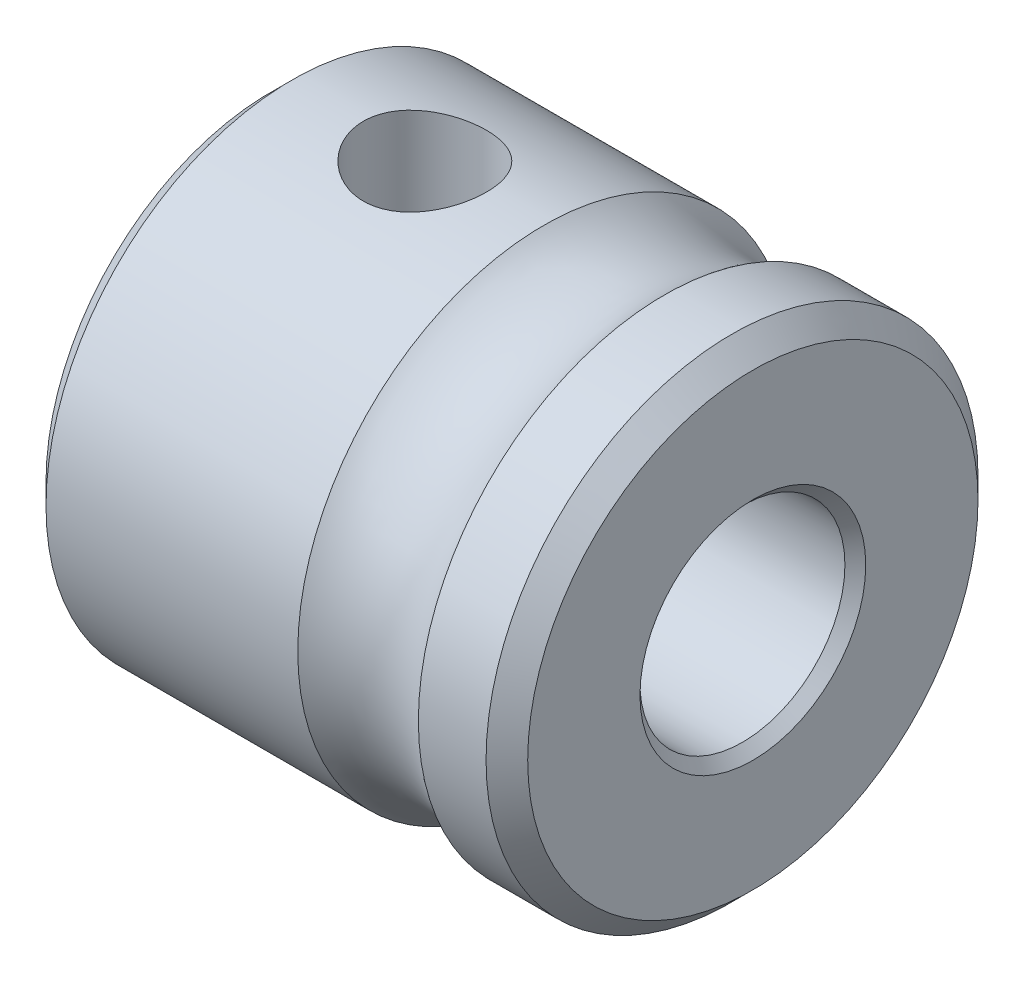
ISO-10303-21;
HEADER;
FILE_DESCRIPTION(('STEP AP214'),'2;1');
FILE_NAME('part.step','',(''),(''),'','','');
FILE_SCHEMA(('AUTOMOTIVE_DESIGN { 1 0 10303 214 1 1 1 1 }'));
ENDSEC;
DATA;
#1=APPLICATION_CONTEXT('core data for automotive mechanical design processes');
#2=APPLICATION_PROTOCOL_DEFINITION('international standard','automotive_design',2000,#1);
#3=PRODUCT_CONTEXT('',#1,'mechanical');
#4=PRODUCT('Part','Part','',(#3));
#5=PRODUCT_RELATED_PRODUCT_CATEGORY('part','',(#4));
#6=PRODUCT_DEFINITION_FORMATION('','',#4);
#7=PRODUCT_DEFINITION_CONTEXT('part definition',#1,'design');
#8=PRODUCT_DEFINITION('design','',#6,#7);
#9=PRODUCT_DEFINITION_SHAPE('','',#8);
#10=(LENGTH_UNIT() NAMED_UNIT(*) SI_UNIT(.MILLI.,.METRE.));
#11=(NAMED_UNIT(*) PLANE_ANGLE_UNIT() SI_UNIT($,.RADIAN.));
#12=(NAMED_UNIT(*) SI_UNIT($,.STERADIAN.) SOLID_ANGLE_UNIT());
#13=UNCERTAINTY_MEASURE_WITH_UNIT(LENGTH_MEASURE(1.E-05),#10,'distance_accuracy_value','');
#14=(GEOMETRIC_REPRESENTATION_CONTEXT(3) GLOBAL_UNCERTAINTY_ASSIGNED_CONTEXT((#13)) GLOBAL_UNIT_ASSIGNED_CONTEXT((#10,
#11,#12)) REPRESENTATION_CONTEXT('',''));
#15=CARTESIAN_POINT('',(0.,0.,0.));
#16=DIRECTION('',(0.,0.,1.));
#17=DIRECTION('',(1.,0.,0.));
#18=AXIS2_PLACEMENT_3D('',#15,#16,#17);
#19=CARTESIAN_POINT('',(-11.75,0.,0.));
#20=DIRECTION('',(1.,0.,0.));
#21=DIRECTION('',(0.,0.,-0.999999999999999));
#22=AXIS2_PLACEMENT_3D('',#19,#20,#21);
#23=CYLINDRICAL_SURFACE('',#22,6.);
#24=CARTESIAN_POINT('',(-11.2419999999999,0.,-3.2612801348364E-13));
#25=DIRECTION('',(1.,0.,0.));
#26=DIRECTION('',(0.,0.,-0.999999999999999));
#27=AXIS2_PLACEMENT_3D('',#24,#25,#26);
#28=CIRCLE('',#27,6.);
#29=CARTESIAN_POINT('',(-11.2419999999999,0.,-6.00000000000032));
#30=VERTEX_POINT('',#29);
#31=EDGE_CURVE('E81',#30,#30,#28,.T.);
#32=ORIENTED_EDGE('',*,*,#31,.T.);
#33=EDGE_LOOP('',(#32));
#34=FACE_BOUND('',#33,.T.);
#35=CARTESIAN_POINT('',(-5.10042822451942,0.,0.));
#36=DIRECTION('',(1.,0.,0.));
#37=DIRECTION('',(0.,0.,-0.999999999999999));
#38=AXIS2_PLACEMENT_3D('',#35,#36,#37);
#39=CIRCLE('',#38,6.);
#40=CARTESIAN_POINT('',(-5.10042822451942,0.,-5.99999999999999));
#41=VERTEX_POINT('',#40);
#42=EDGE_CURVE('E95',#41,#41,#39,.F.);
#43=ORIENTED_EDGE('',*,*,#42,.T.);
#44=EDGE_LOOP('',(#43));
#45=FACE_BOUND('',#44,.T.);
#46=CARTESIAN_POINT('',(-7.99999999999998,5.80947501931115,-1.50000000000027));
#47=CARTESIAN_POINT('',(-7.91716954944525,5.80947660051186,-1.49999764715532));
#48=CARTESIAN_POINT('',(-7.83431306079327,5.81126583608353,-1.49311574729832));
#49=CARTESIAN_POINT('',(-7.6709794530956,5.81821117195957,-1.46581387527859));
#50=CARTESIAN_POINT('',(-7.59050374731892,5.82336923173094,-1.44538602404591));
#51=CARTESIAN_POINT('',(-7.43431787708771,5.83643234757586,-1.39169471977983));
#52=CARTESIAN_POINT('',(-7.35860170676866,5.84433385614251,-1.35844783671292));
#53=CARTESIAN_POINT('',(-7.21381348847612,5.86198915217289,-1.28011268475675));
#54=CARTESIAN_POINT('',(-7.14474172275182,5.87174301827104,-1.23502391313642));
#55=CARTESIAN_POINT('',(-7.01368301284261,5.89224429813369,-1.1332250563872));
#56=CARTESIAN_POINT('',(-6.95186383978998,5.90300758573823,-1.07630213262248));
#57=CARTESIAN_POINT('',(-6.83854316338383,5.92417725309184,-0.952909238460554));
#58=CARTESIAN_POINT('',(-6.78704262462694,5.93458359939838,-0.886438376508465));
#59=CARTESIAN_POINT('',(-6.6951347194212,5.95404249312353,-0.744687120647717));
#60=CARTESIAN_POINT('',(-6.65489216710312,5.9630741244036,-0.669296745717343));
#61=CARTESIAN_POINT('',(-6.58771421350818,5.97858487155596,-0.512557910575811));
#62=CARTESIAN_POINT('',(-6.56077684885072,5.98506436400611,-0.431210331475273));
#63=CARTESIAN_POINT('',(-6.52151129925282,5.99462855308913,-0.266615255252595));
#64=CARTESIAN_POINT('',(-6.50889821340397,5.99777936306595,-0.183439631729521));
#65=CARTESIAN_POINT('',(-6.49774497243463,6.00056156464385,-0.0160972915578912));
#66=CARTESIAN_POINT('',(-6.4992027366743,6.00019347658027,0.068069276722556));
#67=CARTESIAN_POINT('',(-6.51594491015008,5.99602856972127,0.233028370758271));
#68=CARTESIAN_POINT('',(-6.53092179503216,5.99230801404534,0.31385432340132));
#69=CARTESIAN_POINT('',(-6.57378276202895,5.98194501914921,0.471807371120229));
#70=CARTESIAN_POINT('',(-6.60166753122644,5.97530242439068,0.548934269055308));
#71=CARTESIAN_POINT('',(-6.66980154241225,5.95972505820541,0.698110055252437));
#72=CARTESIAN_POINT('',(-6.71016022679694,5.95077011817041,0.770106764649608));
#73=CARTESIAN_POINT('',(-6.80201340746959,5.93153942285798,0.906413433510692));
#74=CARTESIAN_POINT('',(-6.85350984113627,5.92126343791496,0.970722052628201));
#75=CARTESIAN_POINT('',(-6.96782524518934,5.90018228261714,1.09166105262739));
#76=CARTESIAN_POINT('',(-7.03091293540851,5.88937031715559,1.1480365186128));
#77=CARTESIAN_POINT('',(-7.165759984124,5.86869026110032,1.24946456394441));
#78=CARTESIAN_POINT('',(-7.23751974769452,5.85882221463585,1.29451661406875));
#79=CARTESIAN_POINT('',(-7.38817402048933,5.84112298098991,1.37218219353366));
#80=CARTESIAN_POINT('',(-7.46710143818783,5.83330190235439,1.40473435045569));
#81=CARTESIAN_POINT('',(-7.62955128084576,5.82071184083982,1.45602843095454));
#82=CARTESIAN_POINT('',(-7.71307271838978,5.81594220486135,1.47477330982928));
#83=CARTESIAN_POINT('',(-7.87997570091379,5.81013213623488,1.49749778319909));
#84=CARTESIAN_POINT('',(-7.96330267599769,5.80899653456196,1.50185428435192));
#85=CARTESIAN_POINT('',(-8.12949316194677,5.8103240608863,1.49671019430918));
#86=CARTESIAN_POINT('',(-8.21235671477058,5.81278685760762,1.48721087870866));
#87=CARTESIAN_POINT('',(-8.37386855897273,5.8209424917274,1.45495527836196));
#88=CARTESIAN_POINT('',(-8.45256363594252,5.82658182140633,1.43241844096885));
#89=CARTESIAN_POINT('',(-8.60505887471106,5.84040430962585,1.37497084900249));
#90=CARTESIAN_POINT('',(-8.6788584554332,5.8485877694917,1.34005862862752));
#91=CARTESIAN_POINT('',(-8.82106476672035,5.86677682255959,1.25806240076186));
#92=CARTESIAN_POINT('',(-8.88933730402581,5.87681501163992,1.21075305230135));
#93=CARTESIAN_POINT('',(-9.01711301768077,5.89750249843038,1.10559043940166));
#94=CARTESIAN_POINT('',(-9.07661474998999,5.90815189637086,1.04773544220808));
#95=CARTESIAN_POINT('',(-9.18668662554252,5.92918441818967,0.921394081476989));
#96=CARTESIAN_POINT('',(-9.23699603752925,5.93955421237109,0.852677928797318));
#97=CARTESIAN_POINT('',(-9.3253615201707,5.95858329968249,0.707554024041976));
#98=CARTESIAN_POINT('',(-9.36341822996486,5.96724268202381,0.631146673436356));
#99=CARTESIAN_POINT('',(-9.42586762071669,5.98182069442994,0.473337302596588));
#100=CARTESIAN_POINT('',(-9.45035857062737,5.98775898013455,0.391976071541747));
#101=CARTESIAN_POINT('',(-9.48527620076501,5.99631176037479,0.226124640478068));
#102=CARTESIAN_POINT('',(-9.49570559524339,5.99892689636045,0.14163504756168));
#103=CARTESIAN_POINT('',(-9.50205138436323,6.00051254113217,-0.0256252896651666));
#104=CARTESIAN_POINT('',(-9.49835256364298,5.99957968320019,-0.108380740449176));
#105=CARTESIAN_POINT('',(-9.47742825905843,5.99438844686142,-0.272051244622152));
#106=CARTESIAN_POINT('',(-9.46020317748035,5.99013016735643,-0.352966352671339));
#107=CARTESIAN_POINT('',(-9.41292167034359,5.97878149280943,-0.510256553467225));
#108=CARTESIAN_POINT('',(-9.38293482002795,5.97170646754004,-0.58665374187155));
#109=CARTESIAN_POINT('',(-9.31104413147088,5.95546933370083,-0.733375579562371));
#110=CARTESIAN_POINT('',(-9.2691387909956,5.94630696206607,-0.80369946189787));
#111=CARTESIAN_POINT('',(-9.17342714900428,5.92660874522001,-0.93810289263613));
#112=CARTESIAN_POINT('',(-9.11935978563869,5.91604525418421,-1.00199248245102));
#113=CARTESIAN_POINT('',(-9.00136572203909,5.89485973579867,-1.11992253040705));
#114=CARTESIAN_POINT('',(-8.93743652585309,5.88423769428834,-1.1739604876026));
#115=CARTESIAN_POINT('',(-8.80009787869802,5.86391213790825,-1.27164303971913));
#116=CARTESIAN_POINT('',(-8.72653381488098,5.85422945594835,-1.31507492916992));
#117=CARTESIAN_POINT('',(-8.5729167651158,5.83715933325929,-1.38889034492343));
#118=CARTESIAN_POINT('',(-8.49286855083978,5.82977022370053,-1.41928336463954));
#119=CARTESIAN_POINT('',(-8.34413448225985,5.81927863109675,-1.4616337928481));
#120=CARTESIAN_POINT('',(-8.27616025342414,5.81562994500826,-1.47598975589298));
#121=CARTESIAN_POINT('',(-8.1387966965,5.81072757878366,-1.49517343885999));
#122=CARTESIAN_POINT('',(-8.06940748963236,5.80947369434948,-1.50000197155856));
#123=CARTESIAN_POINT('',(-7.99999999999998,5.80947501931115,-1.50000000000027));
#124=B_SPLINE_CURVE_WITH_KNOTS('',3,(#46,#47,#48,#49,#50,#51,#52,#53,#54,#55,#56,#57,#58,#59,
#60,#61,#62,#63,#64,#65,#66,#67,#68,#69,#70,#71,#72,#73,#74,#75,#76,#77,#78,#79,#80,#81,#82,#83,
#84,#85,#86,#87,#88,#89,#90,#91,#92,#93,#94,#95,#96,#97,#98,#99,#100,#101,#102,#103,#104,#105,
#106,#107,#108,#109,#110,#111,#112,#113,#114,#115,#116,#117,#118,#119,#120,#121,#122,#123),
.UNSPECIFIED.,.T.,.F.,(4,2,2,2,2,2,2,2,2,2,2,2,2,2,2,2,2,2,2,2,2,2,2,2,2,2,2,2,2,2,2,2,2,2,2,2,
2,2,4),(0.,0.248236465041644,0.496617444857094,0.74467843629962,0.992749960533055,
1.2457437251579,1.49876112887904,1.75530897838748,2.01181895908267,2.26313250597209,
2.51440889199599,2.76010957613354,3.0058233403486,3.25375724552669,3.5017343128136,
3.75642279943149,4.0111231871988,4.26705859205049,4.52293920077736,4.77206144857034,
5.02116076310292,5.26618443005535,5.51123712852852,5.76109707515495,6.01099811331033,
6.26715198579195,6.5232924943173,6.77755243684166,7.03176329345442,7.27910067676479,
7.5264307042618,7.77242925935835,8.0184588344287,8.27038257949265,8.52237018939321,
8.77905886370815,9.03556032819977,9.24358696306401,9.45159585059714),.UNSPECIFIED.);
#125=CARTESIAN_POINT('',(-7.99999999999998,5.80947501931115,-1.50000000000027));
#126=VERTEX_POINT('',#125);
#127=EDGE_CURVE('E94',#126,#126,#124,.T.);
#128=ORIENTED_EDGE('',*,*,#127,.T.);
#129=EDGE_LOOP('',(#128));
#130=FACE_BOUND('',#129,.T.);
#131=ADVANCED_FACE('F51',(#34,#45,#130),#23,.T.);
#132=CARTESIAN_POINT('',(-11.75,0.,0.));
#133=DIRECTION('',(1.,0.,0.));
#134=DIRECTION('',(0.,0.,-0.999999999999999));
#135=AXIS2_PLACEMENT_3D('',#132,#133,#134);
#136=CYLINDRICAL_SURFACE('',#135,2.5);
#137=CARTESIAN_POINT('',(-0.254000000000004,0.,0.));
#138=DIRECTION('',(1.,0.,0.));
#139=DIRECTION('',(0.,0.,-0.999999999999999));
#140=AXIS2_PLACEMENT_3D('',#137,#138,#139);
#141=CIRCLE('',#140,2.5);
#142=CARTESIAN_POINT('',(-0.254000000000004,0.,-2.49999999999999));
#143=VERTEX_POINT('',#142);
#144=EDGE_CURVE('E59',#143,#143,#141,.T.);
#145=ORIENTED_EDGE('',*,*,#144,.T.);
#146=EDGE_LOOP('',(#145));
#147=FACE_BOUND('',#146,.T.);
#148=CARTESIAN_POINT('',(-11.75,0.,0.));
#149=DIRECTION('',(1.,0.,0.));
#150=DIRECTION('',(0.,0.,-0.999999999999999));
#151=AXIS2_PLACEMENT_3D('',#148,#149,#150);
#152=CIRCLE('',#151,2.5);
#153=CARTESIAN_POINT('',(-11.75,0.,-2.5));
#154=VERTEX_POINT('',#153);
#155=EDGE_CURVE('E85',#154,#154,#152,.T.);
#156=ORIENTED_EDGE('',*,*,#155,.F.);
#157=EDGE_LOOP('',(#156));
#158=FACE_BOUND('',#157,.T.);
#159=CARTESIAN_POINT('',(-7.9999999999999,2.00000000000007,-1.49999999999994));
#160=CARTESIAN_POINT('',(-7.92452102471029,1.99999416642519,-1.50000404108584));
#161=CARTESIAN_POINT('',(-7.84906156592018,2.00433633903489,-1.49426852823997));
#162=CARTESIAN_POINT('',(-7.70067609603773,2.02092590613888,-1.47174965152804));
#163=CARTESIAN_POINT('',(-7.62775281261479,2.03318155043099,-1.45495475788995));
#164=CARTESIAN_POINT('',(-7.4869163583227,2.06362339034729,-1.41143486335855));
#165=CARTESIAN_POINT('',(-7.41897116196487,2.08176666183119,-1.38478154503169));
#166=CARTESIAN_POINT('',(-7.28856254663224,2.12185904995837,-1.32252909283021));
#167=CARTESIAN_POINT('',(-7.22610077030489,2.14380930122418,-1.28692729054717));
#168=CARTESIAN_POINT('',(-7.1000509833359,2.19228594587544,-1.20271292747677));
#169=CARTESIAN_POINT('',(-7.03725904287614,2.21904371037662,-1.15304179435303));
#170=CARTESIAN_POINT('',(-6.92023523725831,2.27226229431062,-1.04426801309996));
#171=CARTESIAN_POINT('',(-6.86600984832913,2.29872287517108,-0.985158296729885));
#172=CARTESIAN_POINT('',(-6.76186619029018,2.35175567858742,-0.851442367412019));
#173=CARTESIAN_POINT('',(-6.71304553633021,2.37803133577823,-0.775851995162723));
#174=CARTESIAN_POINT('',(-6.62919027755555,2.42443786983182,-0.615654228271671));
#175=CARTESIAN_POINT('',(-6.5941430258772,2.44457437988739,-0.53105519662632));
#176=CARTESIAN_POINT('',(-6.54240407718725,2.47470987800446,-0.363771406742666));
#177=CARTESIAN_POINT('',(-6.52427963903263,2.48549303939178,-0.281674698130958));
#178=CARTESIAN_POINT('',(-6.50205719713683,2.49874939277549,-0.114970509382864));
#179=CARTESIAN_POINT('',(-6.4979460219999,2.50123038813305,-0.0303654624003794));
#180=CARTESIAN_POINT('',(-6.50361374734236,2.4978337271154,0.127637283737028));
#181=CARTESIAN_POINT('',(-6.51173352616918,2.49295437513736,0.201123832865363));
#182=CARTESIAN_POINT('',(-6.53847979564799,2.47707997553867,0.345464269151479));
#183=CARTESIAN_POINT('',(-6.5571070639071,2.46608447529311,0.416317961050886));
#184=CARTESIAN_POINT('',(-6.60416556270372,2.43884907201721,0.554056780468839));
#185=CARTESIAN_POINT('',(-6.63265306113888,2.42257910450832,0.620916491037477));
#186=CARTESIAN_POINT('',(-6.69838461622542,2.38609637638758,0.748988660115574));
#187=CARTESIAN_POINT('',(-6.73563094705895,2.36588259201817,0.810199646207977));
#188=CARTESIAN_POINT('',(-6.82283909280441,2.32037925976365,0.933074267143181));
#189=CARTESIAN_POINT('',(-6.87378831173564,2.29477182952158,0.993918663198202));
#190=CARTESIAN_POINT('',(-6.98440411786007,2.2425555424561,1.10671465909267));
#191=CARTESIAN_POINT('',(-7.04408250347444,2.21594536703382,1.15865401308321));
#192=CARTESIAN_POINT('',(-7.17865340616348,2.16111075123951,1.25824837767404));
#193=CARTESIAN_POINT('',(-7.25450757653932,2.13305661385133,1.30470933188636));
#194=CARTESIAN_POINT('',(-7.4147062316365,2.08250879557276,1.38397217194222));
#195=CARTESIAN_POINT('',(-7.49903471612562,2.06000490298826,1.41679921962147));
#196=CARTESIAN_POINT('',(-7.65239363189531,2.02895865196738,1.46077497064819));
#197=CARTESIAN_POINT('',(-7.72004063229654,2.01833888618324,1.47527903312674));
#198=CARTESIAN_POINT('',(-7.85737361029936,2.00392150777565,1.49480872755273));
#199=CARTESIAN_POINT('',(-7.92705712048448,2.0001159611512,1.49984538302845));
#200=CARTESIAN_POINT('',(-8.06655168243568,1.99988914321327,1.50014781114116));
#201=CARTESIAN_POINT('',(-8.1363627772152,2.00347810223992,1.4954000469764));
#202=CARTESIAN_POINT('',(-8.27398734374852,2.0175152078866,1.47640290574958));
#203=CARTESIAN_POINT('',(-8.34179919224019,2.02796877613217,1.46214601830145));
#204=CARTESIAN_POINT('',(-8.47371457947973,2.05431768333105,1.42488312618658));
#205=CARTESIAN_POINT('',(-8.53782263653223,2.07020622092821,1.40188805257369));
#206=CARTESIAN_POINT('',(-8.66147771573016,2.10571539417596,1.34796261057059));
#207=CARTESIAN_POINT('',(-8.72102300636592,2.12533743690004,1.31702924888172));
#208=CARTESIAN_POINT('',(-8.84524008251216,2.17036819177742,1.24167439558463));
#209=CARTESIAN_POINT('',(-8.9089008350966,2.19618239397381,1.19582663060281));
#210=CARTESIAN_POINT('',(-9.02828548484952,2.24821754803633,1.09487395518702));
#211=CARTESIAN_POINT('',(-9.08400169216908,2.27443886711462,1.03976018672399));
#212=CARTESIAN_POINT('',(-9.19322400735032,2.32835625910918,0.913274837212721));
#213=CARTESIAN_POINT('',(-9.24550072660574,2.35580075875878,0.840721108780185));
#214=CARTESIAN_POINT('',(-9.3369027768366,2.40537639133465,0.686103100868022));
#215=CARTESIAN_POINT('',(-9.37603682784088,2.42751104449413,0.604045176134672));
#216=CARTESIAN_POINT('',(-9.43686820343133,2.46252280092779,0.438840232972031));
#217=CARTESIAN_POINT('',(-9.45962622779107,2.47595588067338,0.356205963651102));
#218=CARTESIAN_POINT('',(-9.49071460284622,2.4944073890611,0.187383063890597));
#219=CARTESIAN_POINT('',(-9.49906129071759,2.49943534582743,0.101198571781654));
#220=CARTESIAN_POINT('',(-9.50067460858584,2.5004060046198,-0.059812023201334));
#221=CARTESIAN_POINT('',(-9.49580333456289,2.49747057186331,-0.134620583590039));
#222=CARTESIAN_POINT('',(-9.47510617561828,2.48512948412099,-0.282148755979105));
#223=CARTESIAN_POINT('',(-9.45928016867837,2.47572375706641,-0.354868344702261));
#224=CARTESIAN_POINT('',(-9.41778042841614,2.45149427526961,-0.495145481979106));
#225=CARTESIAN_POINT('',(-9.39226840387057,2.43675966858906,-0.562767032609088));
#226=CARTESIAN_POINT('',(-9.33235940544504,2.40303337447156,-0.692781972000247));
#227=CARTESIAN_POINT('',(-9.29796043914031,2.38404073252271,-0.755174184200152));
#228=CARTESIAN_POINT('',(-9.21707480343118,2.34093432659384,-0.880263645296216));
#229=CARTESIAN_POINT('',(-9.16968129098298,2.31648844639151,-0.942258690440086));
#230=CARTESIAN_POINT('',(-9.06624696628209,2.26601907350664,-1.05789751536313));
#231=CARTESIAN_POINT('',(-9.01019657439197,2.23999385274514,-1.11153190956926));
#232=CARTESIAN_POINT('',(-8.88271443782219,2.1852816566621,-1.21590975350577));
#233=CARTESIAN_POINT('',(-8.81023351383433,2.15667566270905,-1.26542406663366));
#234=CARTESIAN_POINT('',(-8.65651514723332,2.1037646448515,-1.35156817210335));
#235=CARTESIAN_POINT('',(-8.57528228601855,2.07945738811059,-1.38820466322693));
#236=CARTESIAN_POINT('',(-8.41293571486281,2.04080003047968,-1.4443711653516));
#237=CARTESIAN_POINT('',(-8.33240476403872,2.02577665830146,-1.46509526060195));
#238=CARTESIAN_POINT('',(-8.16790260529623,2.00539032320043,-1.49289268240418));
#239=CARTESIAN_POINT('',(-8.08393923424119,2.0000064874465,-1.49999550595834));
#240=CARTESIAN_POINT('',(-7.9999999999999,2.00000000000007,-1.49999999999994));
#241=B_SPLINE_CURVE_WITH_KNOTS('',3,(#159,#160,#161,#162,#163,#164,#165,#166,#167,#168,#169,
#170,#171,#172,#173,#174,#175,#176,#177,#178,#179,#180,#181,#182,#183,#184,#185,#186,#187,#188,
#189,#190,#191,#192,#193,#194,#195,#196,#197,#198,#199,#200,#201,#202,#203,#204,#205,#206,#207,
#208,#209,#210,#211,#212,#213,#214,#215,#216,#217,#218,#219,#220,#221,#222,#223,#224,#225,#226,
#227,#228,#229,#230,#231,#232,#233,#234,#235,#236,#237,#238,#239,#240),.UNSPECIFIED.,.T.,.F.,(4,
2,2,2,2,2,2,2,2,2,2,2,2,2,2,2,2,2,2,2,2,2,2,2,2,2,2,2,2,2,2,2,2,2,2,2,2,2,2,2,4),(0.,
0.226085249493339,0.452406574330568,0.677113624991656,0.901887762215772,1.15414462389989,
1.40659128601829,1.68630157736222,1.96575443271237,2.21853330858499,2.47107452602749,
2.69230130543163,2.91354445887927,3.13607155036375,3.3586564836889,3.60782810055851,
3.85733966656904,4.13576671140276,4.41367760154767,4.62276298054679,4.83160475643975,
5.0407356601118,5.25003193304117,5.45906724365493,5.66818149154676,5.91499438482007,
6.16204457978441,6.44121828011575,6.72020638384839,6.97891479383345,7.23732973022748,
7.46129321849419,7.68525920139666,7.90563970188774,8.126069653946,8.37042963549491,
8.61506198741952,8.89071695766606,9.16622832484803,9.41820120134346,9.66962780912275),.UNSPECIFIED.);
#242=CARTESIAN_POINT('',(-7.9999999999999,2.00000000000007,-1.49999999999994));
#243=VERTEX_POINT('',#242);
#244=EDGE_CURVE('E86',#243,#243,#241,.T.);
#245=ORIENTED_EDGE('',*,*,#244,.F.);
#246=EDGE_LOOP('',(#245));
#247=FACE_BOUND('',#246,.T.);
#248=ADVANCED_FACE('F97',(#147,#158,#247),#136,.F.);
#249=CARTESIAN_POINT('',(-0.507999999999925,0.,-3.2612801348364E-13));
#250=DIRECTION('',(1.,0.,0.));
#251=DIRECTION('',(0.,0.,-0.999999999999999));
#252=AXIS2_PLACEMENT_3D('',#249,#250,#251);
#253=CIRCLE('',#252,6.);
#254=CARTESIAN_POINT('',(-0.507999999999925,0.,-6.00000000000032));
#255=VERTEX_POINT('',#254);
#256=EDGE_CURVE('E66',#255,#255,#253,.F.);
#257=ORIENTED_EDGE('',*,*,#256,.T.);
#258=EDGE_LOOP('',(#257));
#259=FACE_BOUND('',#258,.T.);
#260=CARTESIAN_POINT('',(-2.15899999999994,0.,-3.29597460435593E-13));
#261=DIRECTION('',(-1.,0.,0.));
#262=DIRECTION('',(0.,0.,0.999999999999999));
#263=AXIS2_PLACEMENT_3D('',#260,#261,#262);
#264=CIRCLE('',#263,6.);
#265=CARTESIAN_POINT('',(-2.15899999999994,0.,5.99999999999966));
#266=VERTEX_POINT('',#265);
#267=EDGE_CURVE('E115',#266,#266,#264,.F.);
#268=ORIENTED_EDGE('',*,*,#267,.T.);
#269=EDGE_LOOP('',(#268));
#270=FACE_BOUND('',#269,.T.);
#271=ADVANCED_FACE('F121',(#259,#270),#23,.T.);
#272=CARTESIAN_POINT('',(-11.75,0.,0.));
#273=DIRECTION('',(1.,0.,0.));
#274=DIRECTION('',(0.,0.,-0.999999999999999));
#275=AXIS2_PLACEMENT_3D('',#272,#273,#274);
#276=PLANE('',#275);
#277=CARTESIAN_POINT('',(-11.75,0.,0.));
#278=DIRECTION('',(1.,0.,0.));
#279=DIRECTION('',(0.,0.,-0.999999999999999));
#280=AXIS2_PLACEMENT_3D('',#277,#278,#279);
#281=CIRCLE('',#280,5.492);
#282=CARTESIAN_POINT('',(-11.75,0.,-5.49199999999999));
#283=VERTEX_POINT('',#282);
#284=EDGE_CURVE('E77',#283,#283,#281,.F.);
#285=ORIENTED_EDGE('',*,*,#284,.T.);
#286=EDGE_LOOP('',(#285));
#287=FACE_BOUND('',#286,.T.);
#288=ORIENTED_EDGE('',*,*,#155,.T.);
#289=EDGE_LOOP('',(#288));
#290=FACE_BOUND('',#289,.T.);
#291=ADVANCED_FACE('F137',(#287,#290),#276,.F.);
#292=CARTESIAN_POINT('',(0.,0.,0.));
#293=DIRECTION('',(1.,0.,0.));
#294=DIRECTION('',(0.,0.,-0.999999999999999));
#295=AXIS2_PLACEMENT_3D('',#292,#293,#294);
#296=PLANE('',#295);
#297=CARTESIAN_POINT('',(0.,0.,0.));
#298=DIRECTION('',(1.,0.,0.));
#299=DIRECTION('',(0.,0.,-0.999999999999999));
#300=AXIS2_PLACEMENT_3D('',#297,#298,#299);
#301=CIRCLE('',#300,2.75400000000001);
#302=CARTESIAN_POINT('',(0.,0.,-2.75400000000001));
#303=VERTEX_POINT('',#302);
#304=EDGE_CURVE('E12',#303,#303,#301,.F.);
#305=ORIENTED_EDGE('',*,*,#304,.T.);
#306=EDGE_LOOP('',(#305));
#307=FACE_BOUND('',#306,.T.);
#308=CARTESIAN_POINT('',(0.,0.,0.));
#309=DIRECTION('',(1.,0.,0.));
#310=DIRECTION('',(0.,0.,-0.999999999999999));
#311=AXIS2_PLACEMENT_3D('',#308,#309,#310);
#312=CIRCLE('',#311,5.492);
#313=CARTESIAN_POINT('',(0.,0.,-5.492));
#314=VERTEX_POINT('',#313);
#315=EDGE_CURVE('E72',#314,#314,#312,.T.);
#316=ORIENTED_EDGE('',*,*,#315,.T.);
#317=EDGE_LOOP('',(#316));
#318=FACE_BOUND('',#317,.T.);
#319=ADVANCED_FACE('F122',(#307,#318),#296,.T.);
#320=CARTESIAN_POINT('',(-3.62971411225965,0.,0.));
#321=DIRECTION('',(-1.,0.,0.));
#322=DIRECTION('',(0.,0.,0.999999999999999));
#323=AXIS2_PLACEMENT_3D('',#320,#321,#322);
#324=TOROIDAL_SURFACE('',#323,7.913,2.413);
#325=ORIENTED_EDGE('',*,*,#42,.F.);
#326=EDGE_LOOP('',(#325));
#327=FACE_BOUND('',#326,.T.);
#328=ORIENTED_EDGE('',*,*,#267,.F.);
#329=EDGE_LOOP('',(#328));
#330=FACE_BOUND('',#329,.T.);
#331=ADVANCED_FACE('F105',(#327,#330),#324,.F.);
#332=CARTESIAN_POINT('',(-7.99999999999992,12.,0.));
#333=DIRECTION('',(0.,-0.999999999999999,0.));
#334=DIRECTION('',(0.,0.,-0.999999999999999));
#335=AXIS2_PLACEMENT_3D('',#332,#333,#334);
#336=CYLINDRICAL_SURFACE('',#335,1.5);
#337=ORIENTED_EDGE('',*,*,#127,.F.);
#338=EDGE_LOOP('',(#337));
#339=FACE_BOUND('',#338,.T.);
#340=ORIENTED_EDGE('',*,*,#244,.T.);
#341=EDGE_LOOP('',(#340));
#342=FACE_BOUND('',#341,.T.);
#343=ADVANCED_FACE('F101',(#339,#342),#336,.F.);
#344=CARTESIAN_POINT('',(-11.2419999999999,0.,-3.2612801348364E-13));
#345=DIRECTION('',(1.,0.,0.));
#346=DIRECTION('',(0.,0.,-0.999999999999999));
#347=AXIS2_PLACEMENT_3D('',#344,#345,#346);
#348=CONICAL_SURFACE('',#347,6.,0.78539816339745);
#349=ORIENTED_EDGE('',*,*,#284,.F.);
#350=EDGE_LOOP('',(#349));
#351=FACE_BOUND('',#350,.T.);
#352=ORIENTED_EDGE('',*,*,#31,.F.);
#353=EDGE_LOOP('',(#352));
#354=FACE_BOUND('',#353,.T.);
#355=ADVANCED_FACE('F104',(#351,#354),#348,.T.);
#356=CARTESIAN_POINT('',(0.,0.,0.));
#357=DIRECTION('',(-1.,0.,0.));
#358=DIRECTION('',(0.,0.,0.999999999999999));
#359=AXIS2_PLACEMENT_3D('',#356,#357,#358);
#360=CONICAL_SURFACE('',#359,5.492,0.785398163397444);
#361=ORIENTED_EDGE('',*,*,#256,.F.);
#362=EDGE_LOOP('',(#361));
#363=FACE_BOUND('',#362,.T.);
#364=ORIENTED_EDGE('',*,*,#315,.F.);
#365=EDGE_LOOP('',(#364));
#366=FACE_BOUND('',#365,.T.);
#367=ADVANCED_FACE('F124',(#363,#366),#360,.T.);
#368=CARTESIAN_POINT('',(-0.254000000000004,0.,0.));
#369=DIRECTION('',(1.,0.,0.));
#370=DIRECTION('',(0.,0.,-0.999999999999999));
#371=AXIS2_PLACEMENT_3D('',#368,#369,#370);
#372=CONICAL_SURFACE('',#371,2.5,0.785398163397456);
#373=ORIENTED_EDGE('',*,*,#304,.F.);
#374=EDGE_LOOP('',(#373));
#375=FACE_BOUND('',#374,.T.);
#376=ORIENTED_EDGE('',*,*,#144,.F.);
#377=EDGE_LOOP('',(#376));
#378=FACE_BOUND('',#377,.T.);
#379=ADVANCED_FACE('F53',(#375,#378),#372,.F.);
#380=CLOSED_SHELL('',(#131,#248,#271,#291,#319,#331,#343,#355,#367,#379));
#381=MANIFOLD_SOLID_BREP('B2',#380);
#382=ADVANCED_BREP_SHAPE_REPRESENTATION('',(#18,#381),#14);
#383=SHAPE_DEFINITION_REPRESENTATION(#9,#382);
ENDSEC;
END-ISO-10303-21;
